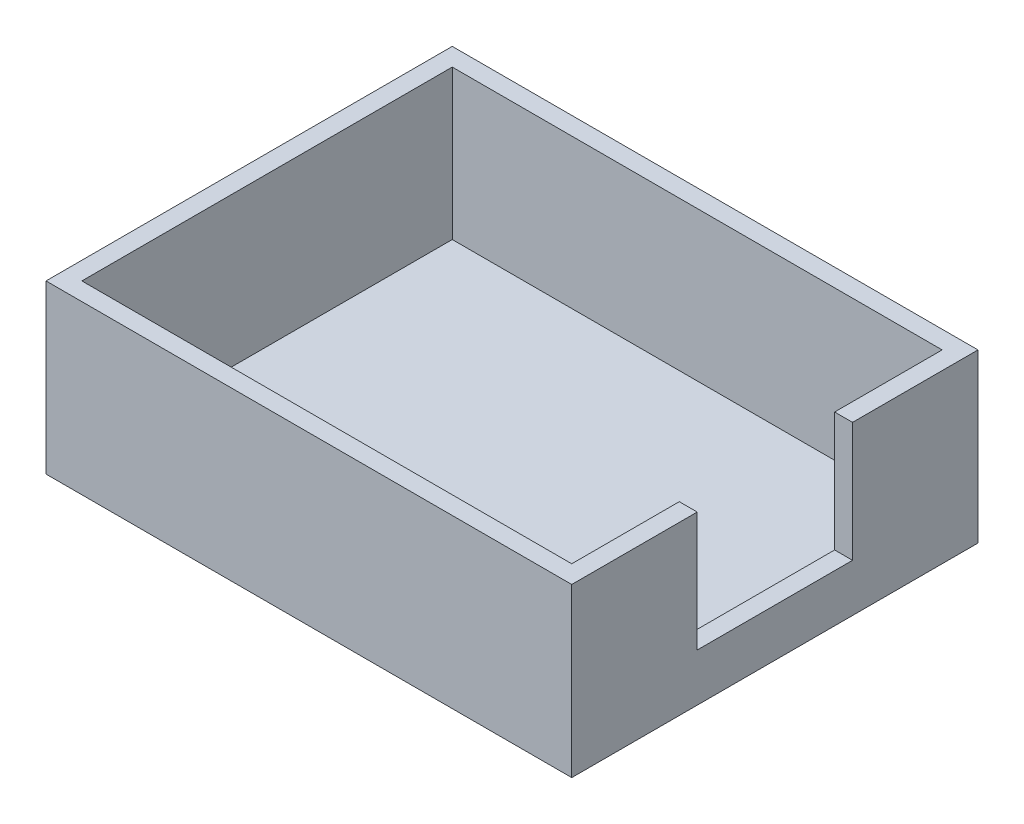
ISO-10303-21;
HEADER;
FILE_DESCRIPTION(('STEP AP214'),'2;1');
FILE_NAME('part.step','',(''),(''),'','','');
FILE_SCHEMA(('AUTOMOTIVE_DESIGN { 1 0 10303 214 1 1 1 1 }'));
ENDSEC;
DATA;
#1=APPLICATION_CONTEXT('core data for automotive mechanical design processes');
#2=APPLICATION_PROTOCOL_DEFINITION('international standard','automotive_design',2000,#1);
#3=PRODUCT_CONTEXT('',#1,'mechanical');
#4=PRODUCT('Part','Part','',(#3));
#5=PRODUCT_RELATED_PRODUCT_CATEGORY('part','',(#4));
#6=PRODUCT_DEFINITION_FORMATION('','',#4);
#7=PRODUCT_DEFINITION_CONTEXT('part definition',#1,'design');
#8=PRODUCT_DEFINITION('design','',#6,#7);
#9=PRODUCT_DEFINITION_SHAPE('','',#8);
#10=(LENGTH_UNIT() NAMED_UNIT(*) SI_UNIT(.MILLI.,.METRE.));
#11=(NAMED_UNIT(*) PLANE_ANGLE_UNIT() SI_UNIT($,.RADIAN.));
#12=(NAMED_UNIT(*) SI_UNIT($,.STERADIAN.) SOLID_ANGLE_UNIT());
#13=UNCERTAINTY_MEASURE_WITH_UNIT(LENGTH_MEASURE(1.E-05),#10,'distance_accuracy_value','');
#14=(GEOMETRIC_REPRESENTATION_CONTEXT(3) GLOBAL_UNCERTAINTY_ASSIGNED_CONTEXT((#13)) GLOBAL_UNIT_ASSIGNED_CONTEXT((#10,
#11,#12)) REPRESENTATION_CONTEXT('',''));
#15=CARTESIAN_POINT('',(0.,0.,0.));
#16=DIRECTION('',(0.,0.,1.));
#17=DIRECTION('',(1.,0.,0.));
#18=AXIS2_PLACEMENT_3D('',#15,#16,#17);
#19=CARTESIAN_POINT('',(22.,14.,-17.));
#20=DIRECTION('',(-1.,0.,0.));
#21=DIRECTION('',(0.,0.,1.));
#22=AXIS2_PLACEMENT_3D('',#19,#20,#21);
#23=PLANE('',#22);
#24=DIRECTION('',(0.,0.,-1.));
#25=VECTOR('',#24,1.);
#26=CARTESIAN_POINT('',(22.,14.,-17.));
#27=LINE('',#26,#25);
#28=CARTESIAN_POINT('',(22.,14.,-6.5));
#29=VERTEX_POINT('',#28);
#30=CARTESIAN_POINT('',(22.,14.,-17.));
#31=VERTEX_POINT('',#30);
#32=EDGE_CURVE('E208',#29,#31,#27,.T.);
#33=ORIENTED_EDGE('',*,*,#32,.F.);
#34=DIRECTION('',(0.,1.,0.));
#35=VECTOR('',#34,1.);
#36=CARTESIAN_POINT('',(22.,4.,-6.5));
#37=LINE('',#36,#35);
#38=CARTESIAN_POINT('',(22.,4.,-6.5));
#39=VERTEX_POINT('',#38);
#40=EDGE_CURVE('E157',#39,#29,#37,.T.);
#41=ORIENTED_EDGE('',*,*,#40,.F.);
#42=DIRECTION('',(0.,0.,-1.));
#43=VECTOR('',#42,1.);
#44=CARTESIAN_POINT('',(22.,4.,-6.5));
#45=LINE('',#44,#43);
#46=CARTESIAN_POINT('',(22.,4.,6.5));
#47=VERTEX_POINT('',#46);
#48=EDGE_CURVE('E138',#47,#39,#45,.T.);
#49=ORIENTED_EDGE('',*,*,#48,.F.);
#50=DIRECTION('',(0.,1.,0.));
#51=VECTOR('',#50,1.);
#52=CARTESIAN_POINT('',(22.,4.,6.5));
#53=LINE('',#52,#51);
#54=CARTESIAN_POINT('',(22.,14.,6.5));
#55=VERTEX_POINT('',#54);
#56=EDGE_CURVE('E135',#47,#55,#53,.T.);
#57=ORIENTED_EDGE('',*,*,#56,.T.);
#58=CARTESIAN_POINT('',(22.,14.,17.));
#59=VERTEX_POINT('',#58);
#60=EDGE_CURVE('E203',#59,#55,#27,.T.);
#61=ORIENTED_EDGE('',*,*,#60,.F.);
#62=DIRECTION('',(0.,-1.,0.));
#63=VECTOR('',#62,1.);
#64=CARTESIAN_POINT('',(22.,14.,17.));
#65=LINE('',#64,#63);
#66=CARTESIAN_POINT('',(22.,0.,17.));
#67=VERTEX_POINT('',#66);
#68=EDGE_CURVE('E217',#59,#67,#65,.T.);
#69=ORIENTED_EDGE('',*,*,#68,.T.);
#70=DIRECTION('',(0.,0.,-1.));
#71=VECTOR('',#70,1.);
#72=CARTESIAN_POINT('',(22.,0.,-17.));
#73=LINE('',#72,#71);
#74=CARTESIAN_POINT('',(22.,0.,-17.));
#75=VERTEX_POINT('',#74);
#76=EDGE_CURVE('E172',#67,#75,#73,.T.);
#77=ORIENTED_EDGE('',*,*,#76,.T.);
#78=DIRECTION('',(0.,-1.,0.));
#79=VECTOR('',#78,1.);
#80=CARTESIAN_POINT('',(22.,14.,-17.));
#81=LINE('',#80,#79);
#82=EDGE_CURVE('E11',#31,#75,#81,.T.);
#83=ORIENTED_EDGE('',*,*,#82,.F.);
#84=EDGE_LOOP('',(#33,#41,#49,#57,#61,#69,#77,#83));
#85=FACE_BOUND('',#84,.T.);
#86=ADVANCED_FACE('F39',(#85),#23,.F.);
#87=CARTESIAN_POINT('',(-22.,14.,-17.));
#88=DIRECTION('',(0.,0.,1.));
#89=DIRECTION('',(1.,0.,0.));
#90=AXIS2_PLACEMENT_3D('',#87,#88,#89);
#91=PLANE('',#90);
#92=DIRECTION('',(-1.,0.,0.));
#93=VECTOR('',#92,1.);
#94=CARTESIAN_POINT('',(-22.,0.,-17.));
#95=LINE('',#94,#93);
#96=CARTESIAN_POINT('',(-22.,0.,-17.));
#97=VERTEX_POINT('',#96);
#98=EDGE_CURVE('E221',#75,#97,#95,.T.);
#99=ORIENTED_EDGE('',*,*,#98,.T.);
#100=DIRECTION('',(0.,-1.,0.));
#101=VECTOR('',#100,1.);
#102=CARTESIAN_POINT('',(-22.,14.,-17.));
#103=LINE('',#102,#101);
#104=CARTESIAN_POINT('',(-22.,14.,-17.));
#105=VERTEX_POINT('',#104);
#106=EDGE_CURVE('E47',#105,#97,#103,.T.);
#107=ORIENTED_EDGE('',*,*,#106,.F.);
#108=DIRECTION('',(-1.,0.,0.));
#109=VECTOR('',#108,1.);
#110=CARTESIAN_POINT('',(-22.,14.,-17.));
#111=LINE('',#110,#109);
#112=EDGE_CURVE('E207',#31,#105,#111,.T.);
#113=ORIENTED_EDGE('',*,*,#112,.F.);
#114=ORIENTED_EDGE('',*,*,#82,.T.);
#115=EDGE_LOOP('',(#99,#107,#113,#114));
#116=FACE_BOUND('',#115,.T.);
#117=ADVANCED_FACE('F262',(#116),#91,.F.);
#118=CARTESIAN_POINT('',(-22.,14.,-17.));
#119=DIRECTION('',(1.,0.,0.));
#120=DIRECTION('',(0.,0.,-1.));
#121=AXIS2_PLACEMENT_3D('',#118,#119,#120);
#122=PLANE('',#121);
#123=DIRECTION('',(0.,0.,1.));
#124=VECTOR('',#123,1.);
#125=CARTESIAN_POINT('',(-22.,0.,-17.));
#126=LINE('',#125,#124);
#127=CARTESIAN_POINT('',(-22.,0.,17.));
#128=VERTEX_POINT('',#127);
#129=EDGE_CURVE('E224',#97,#128,#126,.T.);
#130=ORIENTED_EDGE('',*,*,#129,.T.);
#131=DIRECTION('',(0.,-1.,0.));
#132=VECTOR('',#131,1.);
#133=CARTESIAN_POINT('',(-22.,14.,17.));
#134=LINE('',#133,#132);
#135=CARTESIAN_POINT('',(-22.,14.,17.));
#136=VERTEX_POINT('',#135);
#137=EDGE_CURVE('E233',#136,#128,#134,.T.);
#138=ORIENTED_EDGE('',*,*,#137,.F.);
#139=DIRECTION('',(0.,0.,1.));
#140=VECTOR('',#139,1.);
#141=CARTESIAN_POINT('',(-22.,14.,-17.));
#142=LINE('',#141,#140);
#143=EDGE_CURVE('E211',#105,#136,#142,.T.);
#144=ORIENTED_EDGE('',*,*,#143,.F.);
#145=ORIENTED_EDGE('',*,*,#106,.T.);
#146=EDGE_LOOP('',(#130,#138,#144,#145));
#147=FACE_BOUND('',#146,.T.);
#148=ADVANCED_FACE('F242',(#147),#122,.F.);
#149=CARTESIAN_POINT('',(-22.,14.,17.));
#150=DIRECTION('',(0.,0.,-1.));
#151=DIRECTION('',(-1.,0.,0.));
#152=AXIS2_PLACEMENT_3D('',#149,#150,#151);
#153=PLANE('',#152);
#154=DIRECTION('',(1.,0.,0.));
#155=VECTOR('',#154,1.);
#156=CARTESIAN_POINT('',(-22.,0.,17.));
#157=LINE('',#156,#155);
#158=EDGE_CURVE('E227',#128,#67,#157,.T.);
#159=ORIENTED_EDGE('',*,*,#158,.T.);
#160=ORIENTED_EDGE('',*,*,#68,.F.);
#161=DIRECTION('',(1.,0.,0.));
#162=VECTOR('',#161,1.);
#163=CARTESIAN_POINT('',(-22.,14.,17.));
#164=LINE('',#163,#162);
#165=EDGE_CURVE('E214',#136,#59,#164,.T.);
#166=ORIENTED_EDGE('',*,*,#165,.F.);
#167=ORIENTED_EDGE('',*,*,#137,.T.);
#168=EDGE_LOOP('',(#159,#160,#166,#167));
#169=FACE_BOUND('',#168,.T.);
#170=ADVANCED_FACE('F252',(#169),#153,.F.);
#171=CARTESIAN_POINT('',(0.,14.,0.));
#172=DIRECTION('',(0.,1.,0.));
#173=DIRECTION('',(0.,0.,1.));
#174=AXIS2_PLACEMENT_3D('',#171,#172,#173);
#175=PLANE('',#174);
#176=DIRECTION('',(-1.,0.,0.));
#177=VECTOR('',#176,1.);
#178=CARTESIAN_POINT('',(20.5,14.,-6.5));
#179=LINE('',#178,#177);
#180=CARTESIAN_POINT('',(20.5,14.,-6.5));
#181=VERTEX_POINT('',#180);
#182=EDGE_CURVE('E146',#29,#181,#179,.T.);
#183=ORIENTED_EDGE('',*,*,#182,.F.);
#184=ORIENTED_EDGE('',*,*,#32,.T.);
#185=ORIENTED_EDGE('',*,*,#112,.T.);
#186=ORIENTED_EDGE('',*,*,#143,.T.);
#187=ORIENTED_EDGE('',*,*,#165,.T.);
#188=ORIENTED_EDGE('',*,*,#60,.T.);
#189=DIRECTION('',(1.,0.,0.));
#190=VECTOR('',#189,1.);
#191=CARTESIAN_POINT('',(20.5,14.,6.5));
#192=LINE('',#191,#190);
#193=CARTESIAN_POINT('',(20.5,14.,6.5));
#194=VERTEX_POINT('',#193);
#195=EDGE_CURVE('E261',#194,#55,#192,.T.);
#196=ORIENTED_EDGE('',*,*,#195,.F.);
#197=DIRECTION('',(0.,0.,-1.));
#198=VECTOR('',#197,1.);
#199=CARTESIAN_POINT('',(20.5,14.,-17.));
#200=LINE('',#199,#198);
#201=CARTESIAN_POINT('',(20.5,14.,15.5));
#202=VERTEX_POINT('',#201);
#203=EDGE_CURVE('E152',#202,#194,#200,.T.);
#204=ORIENTED_EDGE('',*,*,#203,.F.);
#205=DIRECTION('',(1.,0.,0.));
#206=VECTOR('',#205,1.);
#207=CARTESIAN_POINT('',(-22.,14.,15.5));
#208=LINE('',#207,#206);
#209=CARTESIAN_POINT('',(-20.5,14.,15.5));
#210=VERTEX_POINT('',#209);
#211=EDGE_CURVE('E178',#210,#202,#208,.T.);
#212=ORIENTED_EDGE('',*,*,#211,.F.);
#213=DIRECTION('',(0.,0.,1.));
#214=VECTOR('',#213,1.);
#215=CARTESIAN_POINT('',(-20.5,14.,-17.));
#216=LINE('',#215,#214);
#217=CARTESIAN_POINT('',(-20.5,14.,-15.5));
#218=VERTEX_POINT('',#217);
#219=EDGE_CURVE('E198',#218,#210,#216,.T.);
#220=ORIENTED_EDGE('',*,*,#219,.F.);
#221=DIRECTION('',(-1.,0.,0.));
#222=VECTOR('',#221,1.);
#223=CARTESIAN_POINT('',(-22.,14.,-15.5));
#224=LINE('',#223,#222);
#225=CARTESIAN_POINT('',(20.5,14.,-15.5));
#226=VERTEX_POINT('',#225);
#227=EDGE_CURVE('E195',#226,#218,#224,.T.);
#228=ORIENTED_EDGE('',*,*,#227,.F.);
#229=EDGE_CURVE('E192',#181,#226,#200,.T.);
#230=ORIENTED_EDGE('',*,*,#229,.F.);
#231=EDGE_LOOP('',(#183,#184,#185,#186,#187,#188,#196,#204,#212,#220,#228,#230));
#232=FACE_BOUND('',#231,.T.);
#233=ADVANCED_FACE('F260',(#232),#175,.T.);
#234=CARTESIAN_POINT('',(0.,0.,0.));
#235=DIRECTION('',(0.,1.,0.));
#236=DIRECTION('',(0.,0.,1.));
#237=AXIS2_PLACEMENT_3D('',#234,#235,#236);
#238=PLANE('',#237);
#239=ORIENTED_EDGE('',*,*,#76,.F.);
#240=ORIENTED_EDGE('',*,*,#158,.F.);
#241=ORIENTED_EDGE('',*,*,#129,.F.);
#242=ORIENTED_EDGE('',*,*,#98,.F.);
#243=EDGE_LOOP('',(#239,#240,#241,#242));
#244=FACE_BOUND('',#243,.T.);
#245=ADVANCED_FACE('F249',(#244),#238,.F.);
#246=CARTESIAN_POINT('',(20.5,14.,-17.));
#247=DIRECTION('',(-1.,0.,0.));
#248=DIRECTION('',(0.,0.,1.));
#249=AXIS2_PLACEMENT_3D('',#246,#247,#248);
#250=PLANE('',#249);
#251=DIRECTION('',(0.,1.,0.));
#252=VECTOR('',#251,1.);
#253=CARTESIAN_POINT('',(20.5,4.,-6.5));
#254=LINE('',#253,#252);
#255=CARTESIAN_POINT('',(20.5,4.,-6.5));
#256=VERTEX_POINT('',#255);
#257=EDGE_CURVE('E167',#256,#181,#254,.T.);
#258=ORIENTED_EDGE('',*,*,#257,.T.);
#259=ORIENTED_EDGE('',*,*,#229,.T.);
#260=DIRECTION('',(0.,-1.,0.));
#261=VECTOR('',#260,1.);
#262=CARTESIAN_POINT('',(20.5,14.,-15.5));
#263=LINE('',#262,#261);
#264=CARTESIAN_POINT('',(20.5,1.5,-15.5));
#265=VERTEX_POINT('',#264);
#266=EDGE_CURVE('E168',#226,#265,#263,.T.);
#267=ORIENTED_EDGE('',*,*,#266,.T.);
#268=DIRECTION('',(0.,0.,-1.));
#269=VECTOR('',#268,1.);
#270=CARTESIAN_POINT('',(20.5,1.5,-17.));
#271=LINE('',#270,#269);
#272=CARTESIAN_POINT('',(20.5,1.5,15.5));
#273=VERTEX_POINT('',#272);
#274=EDGE_CURVE('E162',#273,#265,#271,.T.);
#275=ORIENTED_EDGE('',*,*,#274,.F.);
#276=DIRECTION('',(0.,-1.,0.));
#277=VECTOR('',#276,1.);
#278=CARTESIAN_POINT('',(20.5,14.,15.5));
#279=LINE('',#278,#277);
#280=EDGE_CURVE('E174',#202,#273,#279,.T.);
#281=ORIENTED_EDGE('',*,*,#280,.F.);
#282=ORIENTED_EDGE('',*,*,#203,.T.);
#283=DIRECTION('',(0.,1.,0.));
#284=VECTOR('',#283,1.);
#285=CARTESIAN_POINT('',(20.5,4.,6.5));
#286=LINE('',#285,#284);
#287=CARTESIAN_POINT('',(20.5,4.,6.5));
#288=VERTEX_POINT('',#287);
#289=EDGE_CURVE('E132',#288,#194,#286,.T.);
#290=ORIENTED_EDGE('',*,*,#289,.F.);
#291=DIRECTION('',(0.,0.,1.));
#292=VECTOR('',#291,1.);
#293=CARTESIAN_POINT('',(20.5,4.,-6.5));
#294=LINE('',#293,#292);
#295=EDGE_CURVE('E139',#256,#288,#294,.T.);
#296=ORIENTED_EDGE('',*,*,#295,.F.);
#297=EDGE_LOOP('',(#258,#259,#267,#275,#281,#282,#290,#296));
#298=FACE_BOUND('',#297,.T.);
#299=ADVANCED_FACE('F149',(#298),#250,.T.);
#300=CARTESIAN_POINT('',(-22.,14.,-15.5));
#301=DIRECTION('',(0.,0.,1.));
#302=DIRECTION('',(1.,0.,0.));
#303=AXIS2_PLACEMENT_3D('',#300,#301,#302);
#304=PLANE('',#303);
#305=DIRECTION('',(-1.,0.,0.));
#306=VECTOR('',#305,1.);
#307=CARTESIAN_POINT('',(-22.,1.5,-15.5));
#308=LINE('',#307,#306);
#309=CARTESIAN_POINT('',(-20.5,1.5,-15.5));
#310=VERTEX_POINT('',#309);
#311=EDGE_CURVE('E166',#265,#310,#308,.T.);
#312=ORIENTED_EDGE('',*,*,#311,.F.);
#313=ORIENTED_EDGE('',*,*,#266,.F.);
#314=ORIENTED_EDGE('',*,*,#227,.T.);
#315=DIRECTION('',(0.,-1.,0.));
#316=VECTOR('',#315,1.);
#317=CARTESIAN_POINT('',(-20.5,14.,-15.5));
#318=LINE('',#317,#316);
#319=EDGE_CURVE('E173',#218,#310,#318,.T.);
#320=ORIENTED_EDGE('',*,*,#319,.T.);
#321=EDGE_LOOP('',(#312,#313,#314,#320));
#322=FACE_BOUND('',#321,.T.);
#323=ADVANCED_FACE('F284',(#322),#304,.T.);
#324=CARTESIAN_POINT('',(-20.5,14.,-17.));
#325=DIRECTION('',(1.,0.,0.));
#326=DIRECTION('',(0.,0.,-1.));
#327=AXIS2_PLACEMENT_3D('',#324,#325,#326);
#328=PLANE('',#327);
#329=DIRECTION('',(0.,0.,1.));
#330=VECTOR('',#329,1.);
#331=CARTESIAN_POINT('',(-20.5,1.5,-17.));
#332=LINE('',#331,#330);
#333=CARTESIAN_POINT('',(-20.5,1.5,15.5));
#334=VERTEX_POINT('',#333);
#335=EDGE_CURVE('E181',#310,#334,#332,.T.);
#336=ORIENTED_EDGE('',*,*,#335,.F.);
#337=ORIENTED_EDGE('',*,*,#319,.F.);
#338=ORIENTED_EDGE('',*,*,#219,.T.);
#339=DIRECTION('',(0.,-1.,0.));
#340=VECTOR('',#339,1.);
#341=CARTESIAN_POINT('',(-20.5,14.,15.5));
#342=LINE('',#341,#340);
#343=EDGE_CURVE('E62',#210,#334,#342,.T.);
#344=ORIENTED_EDGE('',*,*,#343,.T.);
#345=EDGE_LOOP('',(#336,#337,#338,#344));
#346=FACE_BOUND('',#345,.T.);
#347=ADVANCED_FACE('F287',(#346),#328,.T.);
#348=CARTESIAN_POINT('',(-22.,14.,15.5));
#349=DIRECTION('',(0.,0.,-1.));
#350=DIRECTION('',(-1.,0.,0.));
#351=AXIS2_PLACEMENT_3D('',#348,#349,#350);
#352=PLANE('',#351);
#353=DIRECTION('',(1.,0.,0.));
#354=VECTOR('',#353,1.);
#355=CARTESIAN_POINT('',(-22.,1.5,15.5));
#356=LINE('',#355,#354);
#357=EDGE_CURVE('E187',#334,#273,#356,.T.);
#358=ORIENTED_EDGE('',*,*,#357,.F.);
#359=ORIENTED_EDGE('',*,*,#343,.F.);
#360=ORIENTED_EDGE('',*,*,#211,.T.);
#361=ORIENTED_EDGE('',*,*,#280,.T.);
#362=EDGE_LOOP('',(#358,#359,#360,#361));
#363=FACE_BOUND('',#362,.T.);
#364=ADVANCED_FACE('F291',(#363),#352,.T.);
#365=CARTESIAN_POINT('',(0.,1.5,0.));
#366=DIRECTION('',(0.,1.,0.));
#367=DIRECTION('',(0.,0.,1.));
#368=AXIS2_PLACEMENT_3D('',#365,#366,#367);
#369=PLANE('',#368);
#370=ORIENTED_EDGE('',*,*,#274,.T.);
#371=ORIENTED_EDGE('',*,*,#311,.T.);
#372=ORIENTED_EDGE('',*,*,#335,.T.);
#373=ORIENTED_EDGE('',*,*,#357,.T.);
#374=EDGE_LOOP('',(#370,#371,#372,#373));
#375=FACE_BOUND('',#374,.T.);
#376=ADVANCED_FACE('F289',(#375),#369,.T.);
#377=CARTESIAN_POINT('',(20.5,4.,-6.5));
#378=DIRECTION('',(0.,0.,-1.));
#379=DIRECTION('',(-1.,0.,0.));
#380=AXIS2_PLACEMENT_3D('',#377,#378,#379);
#381=PLANE('',#380);
#382=ORIENTED_EDGE('',*,*,#182,.T.);
#383=ORIENTED_EDGE('',*,*,#257,.F.);
#384=DIRECTION('',(-1.,0.,0.));
#385=VECTOR('',#384,1.);
#386=CARTESIAN_POINT('',(20.5,4.,-6.5));
#387=LINE('',#386,#385);
#388=EDGE_CURVE('E54',#39,#256,#387,.T.);
#389=ORIENTED_EDGE('',*,*,#388,.F.);
#390=ORIENTED_EDGE('',*,*,#40,.T.);
#391=EDGE_LOOP('',(#382,#383,#389,#390));
#392=FACE_BOUND('',#391,.T.);
#393=ADVANCED_FACE('F276',(#392),#381,.F.);
#394=CARTESIAN_POINT('',(20.5,4.,6.5));
#395=DIRECTION('',(0.,0.,1.));
#396=DIRECTION('',(1.,0.,0.));
#397=AXIS2_PLACEMENT_3D('',#394,#395,#396);
#398=PLANE('',#397);
#399=ORIENTED_EDGE('',*,*,#195,.T.);
#400=ORIENTED_EDGE('',*,*,#56,.F.);
#401=DIRECTION('',(1.,0.,0.));
#402=VECTOR('',#401,1.);
#403=CARTESIAN_POINT('',(20.5,4.,6.5));
#404=LINE('',#403,#402);
#405=EDGE_CURVE('E129',#288,#47,#404,.T.);
#406=ORIENTED_EDGE('',*,*,#405,.F.);
#407=ORIENTED_EDGE('',*,*,#289,.T.);
#408=EDGE_LOOP('',(#399,#400,#406,#407));
#409=FACE_BOUND('',#408,.T.);
#410=ADVANCED_FACE('F130',(#409),#398,.F.);
#411=CARTESIAN_POINT('',(0.,4.,0.));
#412=DIRECTION('',(0.,1.,0.));
#413=DIRECTION('',(0.,0.,1.));
#414=AXIS2_PLACEMENT_3D('',#411,#412,#413);
#415=PLANE('',#414);
#416=ORIENTED_EDGE('',*,*,#295,.T.);
#417=ORIENTED_EDGE('',*,*,#405,.T.);
#418=ORIENTED_EDGE('',*,*,#48,.T.);
#419=ORIENTED_EDGE('',*,*,#388,.T.);
#420=EDGE_LOOP('',(#416,#417,#418,#419));
#421=FACE_BOUND('',#420,.T.);
#422=ADVANCED_FACE('F142',(#421),#415,.T.);
#423=CLOSED_SHELL('',(#86,#117,#148,#170,#233,#245,#299,#323,#347,#364,#376,#393,#410,#422));
#424=MANIFOLD_SOLID_BREP('B2',#423);
#425=ADVANCED_BREP_SHAPE_REPRESENTATION('',(#18,#424),#14);
#426=SHAPE_DEFINITION_REPRESENTATION(#9,#425);
ENDSEC;
END-ISO-10303-21;
